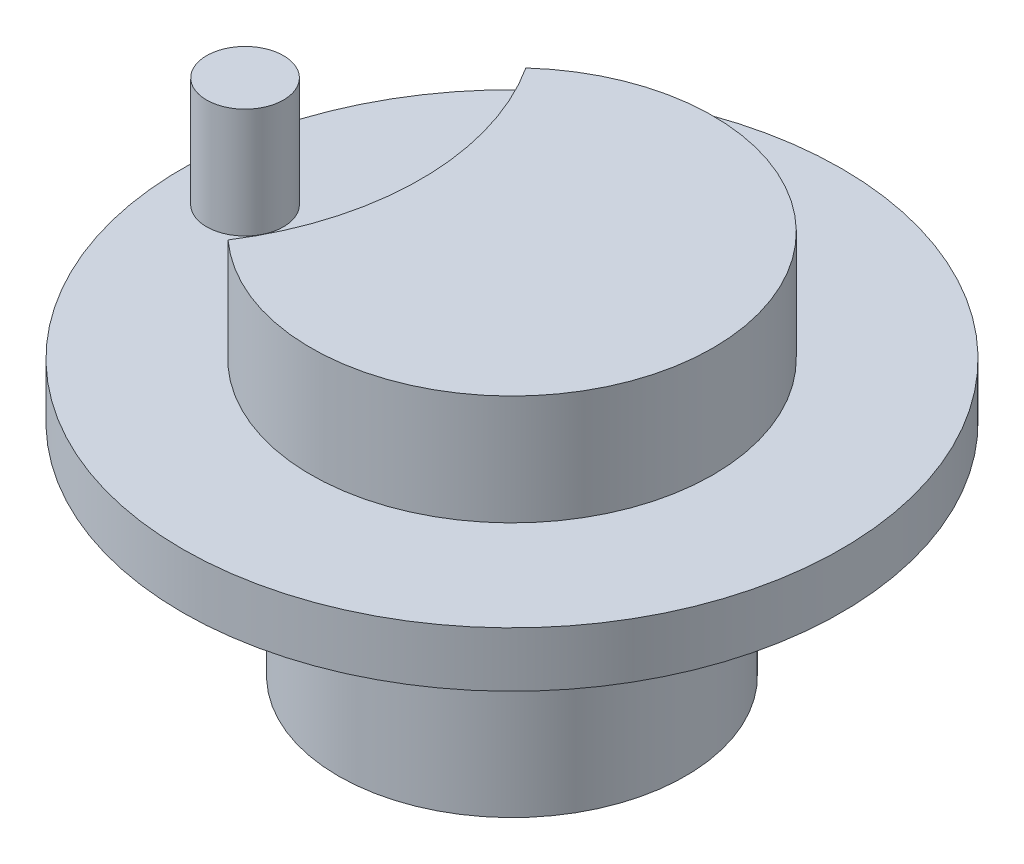
ISO-10303-21;
HEADER;
FILE_DESCRIPTION(('STEP AP214'),'2;1');
FILE_NAME('part.step','',(''),(''),'','','');
FILE_SCHEMA(('AUTOMOTIVE_DESIGN { 1 0 10303 214 1 1 1 1 }'));
ENDSEC;
DATA;
#1=APPLICATION_CONTEXT('core data for automotive mechanical design processes');
#2=APPLICATION_PROTOCOL_DEFINITION('international standard','automotive_design',2000,#1);
#3=PRODUCT_CONTEXT('',#1,'mechanical');
#4=PRODUCT('Part','Part','',(#3));
#5=PRODUCT_RELATED_PRODUCT_CATEGORY('part','',(#4));
#6=PRODUCT_DEFINITION_FORMATION('','',#4);
#7=PRODUCT_DEFINITION_CONTEXT('part definition',#1,'design');
#8=PRODUCT_DEFINITION('design','',#6,#7);
#9=PRODUCT_DEFINITION_SHAPE('','',#8);
#10=(LENGTH_UNIT() NAMED_UNIT(*) SI_UNIT(.MILLI.,.METRE.));
#11=(NAMED_UNIT(*) PLANE_ANGLE_UNIT() SI_UNIT($,.RADIAN.));
#12=(NAMED_UNIT(*) SI_UNIT($,.STERADIAN.) SOLID_ANGLE_UNIT());
#13=UNCERTAINTY_MEASURE_WITH_UNIT(LENGTH_MEASURE(1.E-05),#10,'distance_accuracy_value','');
#14=(GEOMETRIC_REPRESENTATION_CONTEXT(3) GLOBAL_UNCERTAINTY_ASSIGNED_CONTEXT((#13)) GLOBAL_UNIT_ASSIGNED_CONTEXT((#10,
#11,#12)) REPRESENTATION_CONTEXT('',''));
#15=CARTESIAN_POINT('',(0.,0.,0.));
#16=DIRECTION('',(0.,0.,1.));
#17=DIRECTION('',(1.,0.,0.));
#18=AXIS2_PLACEMENT_3D('',#15,#16,#17);
#19=CARTESIAN_POINT('',(0.,2.5,0.));
#20=DIRECTION('',(0.,-1.,0.));
#21=DIRECTION('',(0.,0.,-1.));
#22=AXIS2_PLACEMENT_3D('',#19,#20,#21);
#23=CYLINDRICAL_SURFACE('',#22,15.);
#24=CARTESIAN_POINT('',(0.,2.5,0.));
#25=DIRECTION('',(0.,1.,0.));
#26=DIRECTION('',(0.,0.,1.));
#27=AXIS2_PLACEMENT_3D('',#24,#25,#26);
#28=CIRCLE('',#27,15.);
#29=CARTESIAN_POINT('',(0.,2.5,15.));
#30=VERTEX_POINT('',#29);
#31=EDGE_CURVE('E44',#30,#30,#28,.T.);
#32=ORIENTED_EDGE('',*,*,#31,.F.);
#33=EDGE_LOOP('',(#32));
#34=FACE_BOUND('',#33,.T.);
#35=CARTESIAN_POINT('',(0.,0.,0.));
#36=DIRECTION('',(0.,1.,0.));
#37=DIRECTION('',(0.,0.,1.));
#38=AXIS2_PLACEMENT_3D('',#35,#36,#37);
#39=CIRCLE('',#38,15.);
#40=CARTESIAN_POINT('',(0.,0.,15.));
#41=VERTEX_POINT('',#40);
#42=EDGE_CURVE('E83',#41,#41,#39,.T.);
#43=ORIENTED_EDGE('',*,*,#42,.T.);
#44=EDGE_LOOP('',(#43));
#45=FACE_BOUND('',#44,.T.);
#46=ADVANCED_FACE('F37',(#34,#45),#23,.T.);
#47=CARTESIAN_POINT('',(0.,2.5,0.));
#48=DIRECTION('',(0.,1.,0.));
#49=DIRECTION('',(0.,0.,1.));
#50=AXIS2_PLACEMENT_3D('',#47,#48,#49);
#51=PLANE('',#50);
#52=CARTESIAN_POINT('',(-12.15,2.5,0.));
#53=DIRECTION('',(0.,1.,0.));
#54=DIRECTION('',(0.,0.,1.));
#55=AXIS2_PLACEMENT_3D('',#52,#53,#54);
#56=CIRCLE('',#55,1.75);
#57=CARTESIAN_POINT('',(-12.15,2.5,1.75));
#58=VERTEX_POINT('',#57);
#59=EDGE_CURVE('E184',#58,#58,#56,.T.);
#60=ORIENTED_EDGE('',*,*,#59,.F.);
#61=EDGE_LOOP('',(#60));
#62=FACE_BOUND('',#61,.T.);
#63=CARTESIAN_POINT('',(-16.65,2.5,0.));
#64=DIRECTION('',(0.,1.,0.));
#65=DIRECTION('',(0.,0.,1.));
#66=AXIS2_PLACEMENT_3D('',#63,#64,#65);
#67=CIRCLE('',#66,12.5);
#68=CARTESIAN_POINT('',(-6.146996996997,2.5,6.77767865267378));
#69=VERTEX_POINT('',#68);
#70=CARTESIAN_POINT('',(-6.146996996997,2.5,-6.77767865267378));
#71=VERTEX_POINT('',#70);
#72=EDGE_CURVE('E50',#69,#71,#67,.T.);
#73=ORIENTED_EDGE('',*,*,#72,.T.);
#74=CARTESIAN_POINT('',(0.,2.5,0.));
#75=DIRECTION('',(0.,1.,0.));
#76=DIRECTION('',(0.,0.,1.));
#77=AXIS2_PLACEMENT_3D('',#74,#75,#76);
#78=CIRCLE('',#77,9.15);
#79=EDGE_CURVE('E64',#69,#71,#78,.T.);
#80=ORIENTED_EDGE('',*,*,#79,.F.);
#81=EDGE_LOOP('',(#73,#80));
#82=FACE_BOUND('',#81,.T.);
#83=ORIENTED_EDGE('',*,*,#31,.T.);
#84=EDGE_LOOP('',(#83));
#85=FACE_BOUND('',#84,.T.);
#86=ADVANCED_FACE('F65',(#62,#82,#85),#51,.T.);
#87=CARTESIAN_POINT('',(0.,0.,0.));
#88=DIRECTION('',(0.,1.,0.));
#89=DIRECTION('',(0.,0.,1.));
#90=AXIS2_PLACEMENT_3D('',#87,#88,#89);
#91=PLANE('',#90);
#92=CARTESIAN_POINT('',(0.,0.,0.));
#93=DIRECTION('',(0.,1.,0.));
#94=DIRECTION('',(0.,0.,1.));
#95=AXIS2_PLACEMENT_3D('',#92,#93,#94);
#96=CIRCLE('',#95,7.9);
#97=CARTESIAN_POINT('',(0.,0.,7.9));
#98=VERTEX_POINT('',#97);
#99=EDGE_CURVE('E11',#98,#98,#96,.F.);
#100=ORIENTED_EDGE('',*,*,#99,.F.);
#101=EDGE_LOOP('',(#100));
#102=FACE_BOUND('',#101,.T.);
#103=ORIENTED_EDGE('',*,*,#42,.F.);
#104=EDGE_LOOP('',(#103));
#105=FACE_BOUND('',#104,.T.);
#106=ADVANCED_FACE('F89',(#102,#105),#91,.F.);
#107=CARTESIAN_POINT('',(0.,7.5,0.));
#108=DIRECTION('',(0.,-1.,0.));
#109=DIRECTION('',(0.,0.,-1.));
#110=AXIS2_PLACEMENT_3D('',#107,#108,#109);
#111=CYLINDRICAL_SURFACE('',#110,9.15);
#112=ORIENTED_EDGE('',*,*,#79,.T.);
#113=DIRECTION('',(0.,-1.,0.));
#114=VECTOR('',#113,1.);
#115=CARTESIAN_POINT('',(-6.146996996997,7.5,-6.77767865267378));
#116=LINE('',#115,#114);
#117=CARTESIAN_POINT('',(-6.146996996997,7.5,-6.77767865267378));
#118=VERTEX_POINT('',#117);
#119=EDGE_CURVE('E74',#118,#71,#116,.T.);
#120=ORIENTED_EDGE('',*,*,#119,.F.);
#121=CARTESIAN_POINT('',(0.,7.5,0.));
#122=DIRECTION('',(0.,1.,0.));
#123=DIRECTION('',(0.,0.,1.));
#124=AXIS2_PLACEMENT_3D('',#121,#122,#123);
#125=CIRCLE('',#124,9.15);
#126=CARTESIAN_POINT('',(-6.146996996997,7.5,6.77767865267378));
#127=VERTEX_POINT('',#126);
#128=EDGE_CURVE('E72',#127,#118,#125,.T.);
#129=ORIENTED_EDGE('',*,*,#128,.F.);
#130=DIRECTION('',(0.,-1.,0.));
#131=VECTOR('',#130,1.);
#132=CARTESIAN_POINT('',(-6.146996996997,7.5,6.77767865267378));
#133=LINE('',#132,#131);
#134=EDGE_CURVE('E58',#127,#69,#133,.T.);
#135=ORIENTED_EDGE('',*,*,#134,.T.);
#136=EDGE_LOOP('',(#112,#120,#129,#135));
#137=FACE_BOUND('',#136,.T.);
#138=ADVANCED_FACE('F71',(#137),#111,.T.);
#139=CARTESIAN_POINT('',(-16.65,7.5,0.));
#140=DIRECTION('',(0.,-1.,0.));
#141=DIRECTION('',(0.,0.,-1.));
#142=AXIS2_PLACEMENT_3D('',#139,#140,#141);
#143=CYLINDRICAL_SURFACE('',#142,12.5);
#144=ORIENTED_EDGE('',*,*,#72,.F.);
#145=ORIENTED_EDGE('',*,*,#134,.F.);
#146=CARTESIAN_POINT('',(-16.65,7.5,0.));
#147=DIRECTION('',(0.,1.,0.));
#148=DIRECTION('',(0.,0.,1.));
#149=AXIS2_PLACEMENT_3D('',#146,#147,#148);
#150=CIRCLE('',#149,12.5);
#151=EDGE_CURVE('E75',#127,#118,#150,.T.);
#152=ORIENTED_EDGE('',*,*,#151,.T.);
#153=ORIENTED_EDGE('',*,*,#119,.T.);
#154=EDGE_LOOP('',(#144,#145,#152,#153));
#155=FACE_BOUND('',#154,.T.);
#156=ADVANCED_FACE('F77',(#155),#143,.F.);
#157=CARTESIAN_POINT('',(-8.325,7.5,0.));
#158=DIRECTION('',(0.,1.,0.));
#159=DIRECTION('',(0.,0.,1.));
#160=AXIS2_PLACEMENT_3D('',#157,#158,#159);
#161=PLANE('',#160);
#162=ORIENTED_EDGE('',*,*,#128,.T.);
#163=ORIENTED_EDGE('',*,*,#151,.F.);
#164=EDGE_LOOP('',(#162,#163));
#165=FACE_BOUND('',#164,.T.);
#166=ADVANCED_FACE('F125',(#165),#161,.T.);
#167=CARTESIAN_POINT('',(-12.15,7.5,0.));
#168=DIRECTION('',(0.,-1.,0.));
#169=DIRECTION('',(0.,0.,-1.));
#170=AXIS2_PLACEMENT_3D('',#167,#168,#169);
#171=CYLINDRICAL_SURFACE('',#170,1.75);
#172=CARTESIAN_POINT('',(-12.15,7.5,0.));
#173=DIRECTION('',(0.,1.,0.));
#174=DIRECTION('',(0.,0.,1.));
#175=AXIS2_PLACEMENT_3D('',#172,#173,#174);
#176=CIRCLE('',#175,1.75);
#177=CARTESIAN_POINT('',(-12.15,7.5,1.75));
#178=VERTEX_POINT('',#177);
#179=EDGE_CURVE('E69',#178,#178,#176,.T.);
#180=ORIENTED_EDGE('',*,*,#179,.F.);
#181=EDGE_LOOP('',(#180));
#182=FACE_BOUND('',#181,.T.);
#183=ORIENTED_EDGE('',*,*,#59,.T.);
#184=EDGE_LOOP('',(#183));
#185=FACE_BOUND('',#184,.T.);
#186=ADVANCED_FACE('F134',(#182,#185),#171,.T.);
#187=CARTESIAN_POINT('',(-12.15,7.5,0.));
#188=DIRECTION('',(0.,1.,0.));
#189=DIRECTION('',(0.,0.,1.));
#190=AXIS2_PLACEMENT_3D('',#187,#188,#189);
#191=PLANE('',#190);
#192=ORIENTED_EDGE('',*,*,#179,.T.);
#193=EDGE_LOOP('',(#192));
#194=FACE_BOUND('',#193,.T.);
#195=ADVANCED_FACE('F144',(#194),#191,.T.);
#196=CARTESIAN_POINT('',(0.,-10.,0.));
#197=DIRECTION('',(0.,1.,0.));
#198=DIRECTION('',(0.,0.,1.));
#199=AXIS2_PLACEMENT_3D('',#196,#197,#198);
#200=CYLINDRICAL_SURFACE('',#199,7.9);
#201=CARTESIAN_POINT('',(0.,-10.,0.));
#202=DIRECTION('',(0.,-1.,0.));
#203=DIRECTION('',(0.,0.,-1.));
#204=AXIS2_PLACEMENT_3D('',#201,#202,#203);
#205=CIRCLE('',#204,7.9);
#206=CARTESIAN_POINT('',(0.,-10.,-7.9));
#207=VERTEX_POINT('',#206);
#208=EDGE_CURVE('E183',#207,#207,#205,.T.);
#209=ORIENTED_EDGE('',*,*,#208,.F.);
#210=EDGE_LOOP('',(#209));
#211=FACE_BOUND('',#210,.T.);
#212=ORIENTED_EDGE('',*,*,#99,.T.);
#213=EDGE_LOOP('',(#212));
#214=FACE_BOUND('',#213,.T.);
#215=ADVANCED_FACE('F153',(#211,#214),#200,.T.);
#216=CARTESIAN_POINT('',(0.,-10.,0.));
#217=DIRECTION('',(0.,-1.,0.));
#218=DIRECTION('',(0.,0.,-1.));
#219=AXIS2_PLACEMENT_3D('',#216,#217,#218);
#220=PLANE('',#219);
#221=ORIENTED_EDGE('',*,*,#208,.T.);
#222=EDGE_LOOP('',(#221));
#223=FACE_BOUND('',#222,.T.);
#224=ADVANCED_FACE('F167',(#223),#220,.T.);
#225=CLOSED_SHELL('',(#46,#86,#106,#138,#156,#166,#186,#195,#215,#224));
#226=MANIFOLD_SOLID_BREP('B2',#225);
#227=ADVANCED_BREP_SHAPE_REPRESENTATION('',(#18,#226),#14);
#228=SHAPE_DEFINITION_REPRESENTATION(#9,#227);
ENDSEC;
END-ISO-10303-21;
